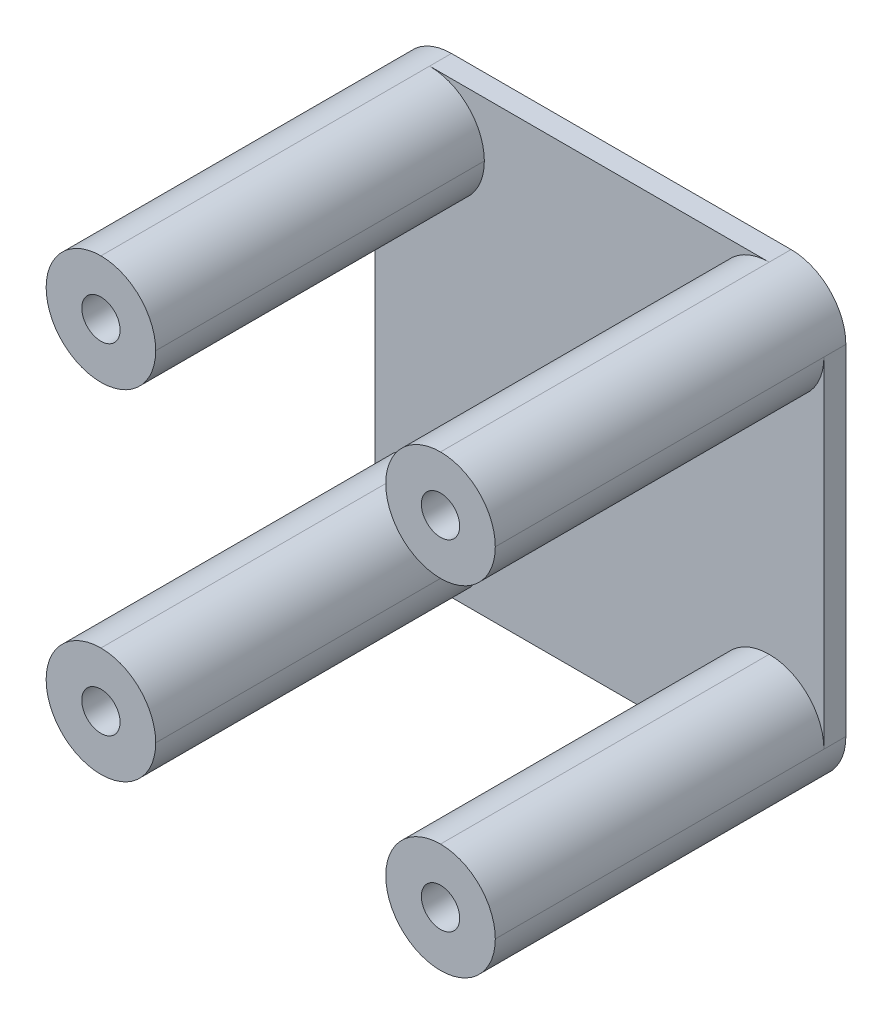
ISO-10303-21;
HEADER;
FILE_DESCRIPTION(('STEP AP214'),'2;1');
FILE_NAME('part.step','',(''),(''),'','','');
FILE_SCHEMA(('AUTOMOTIVE_DESIGN { 1 0 10303 214 1 1 1 1 }'));
ENDSEC;
DATA;
#1=APPLICATION_CONTEXT('core data for automotive mechanical design processes');
#2=APPLICATION_PROTOCOL_DEFINITION('international standard','automotive_design',2000,#1);
#3=PRODUCT_CONTEXT('',#1,'mechanical');
#4=PRODUCT('Part','Part','',(#3));
#5=PRODUCT_RELATED_PRODUCT_CATEGORY('part','',(#4));
#6=PRODUCT_DEFINITION_FORMATION('','',#4);
#7=PRODUCT_DEFINITION_CONTEXT('part definition',#1,'design');
#8=PRODUCT_DEFINITION('design','',#6,#7);
#9=PRODUCT_DEFINITION_SHAPE('','',#8);
#10=(LENGTH_UNIT() NAMED_UNIT(*) SI_UNIT(.MILLI.,.METRE.));
#11=(NAMED_UNIT(*) PLANE_ANGLE_UNIT() SI_UNIT($,.RADIAN.));
#12=(NAMED_UNIT(*) SI_UNIT($,.STERADIAN.) SOLID_ANGLE_UNIT());
#13=UNCERTAINTY_MEASURE_WITH_UNIT(LENGTH_MEASURE(1.E-05),#10,'distance_accuracy_value','');
#14=(GEOMETRIC_REPRESENTATION_CONTEXT(3) GLOBAL_UNCERTAINTY_ASSIGNED_CONTEXT((#13)) GLOBAL_UNIT_ASSIGNED_CONTEXT((#10,
#11,#12)) REPRESENTATION_CONTEXT('',''));
#15=CARTESIAN_POINT('',(0.,0.,0.));
#16=DIRECTION('',(0.,0.,1.));
#17=DIRECTION('',(1.,0.,0.));
#18=AXIS2_PLACEMENT_3D('',#15,#16,#17);
#19=CARTESIAN_POINT('',(0.,0.,2.));
#20=DIRECTION('',(0.,0.,1.));
#21=DIRECTION('',(1.,0.,0.));
#22=AXIS2_PLACEMENT_3D('',#19,#20,#21);
#23=PLANE('',#22);
#24=CARTESIAN_POINT('',(-34.5083333333333,4.35624999999999,2.));
#25=DIRECTION('',(0.,0.,1.));
#26=DIRECTION('',(1.,0.,0.));
#27=AXIS2_PLACEMENT_3D('',#24,#25,#26);
#28=CIRCLE('',#27,1.25);
#29=CARTESIAN_POINT('',(-33.2583333333333,4.35624999999999,2.));
#30=VERTEX_POINT('',#29);
#31=EDGE_CURVE('E449',#30,#30,#28,.T.);
#32=ORIENTED_EDGE('',*,*,#31,.F.);
#33=EDGE_LOOP('',(#32));
#34=FACE_BOUND('',#33,.T.);
#35=CARTESIAN_POINT('',(-19.0083333333333,19.85625,2.));
#36=DIRECTION('',(0.,0.,1.));
#37=DIRECTION('',(1.,0.,0.));
#38=AXIS2_PLACEMENT_3D('',#35,#36,#37);
#39=CIRCLE('',#38,5.);
#40=CARTESIAN_POINT('',(-14.0083333333333,19.85625,2.));
#41=VERTEX_POINT('',#40);
#42=CARTESIAN_POINT('',(-19.0083333333333,14.85625,2.));
#43=VERTEX_POINT('',#42);
#44=EDGE_CURVE('E57',#41,#43,#39,.F.);
#45=ORIENTED_EDGE('',*,*,#44,.T.);
#46=CARTESIAN_POINT('',(-19.0083333333333,19.85625,2.));
#47=DIRECTION('',(0.,0.,1.));
#48=DIRECTION('',(1.,0.,0.));
#49=AXIS2_PLACEMENT_3D('',#46,#47,#48);
#50=CIRCLE('',#49,5.);
#51=CARTESIAN_POINT('',(-24.0083333333333,19.85625,2.));
#52=VERTEX_POINT('',#51);
#53=EDGE_CURVE('E49',#43,#52,#50,.F.);
#54=ORIENTED_EDGE('',*,*,#53,.T.);
#55=CARTESIAN_POINT('',(-19.0083333333333,19.85625,2.));
#56=DIRECTION('',(0.,0.,1.));
#57=DIRECTION('',(1.,0.,0.));
#58=AXIS2_PLACEMENT_3D('',#55,#56,#57);
#59=CIRCLE('',#58,5.);
#60=CARTESIAN_POINT('',(-19.0083333333333,24.85625,2.));
#61=VERTEX_POINT('',#60);
#62=EDGE_CURVE('E219',#52,#61,#59,.F.);
#63=ORIENTED_EDGE('',*,*,#62,.T.);
#64=DIRECTION('',(-1.,0.,0.));
#65=VECTOR('',#64,1.);
#66=CARTESIAN_POINT('',(-55.0083333333333,24.85625,2.));
#67=LINE('',#66,#65);
#68=CARTESIAN_POINT('',(-50.0083333333333,24.85625,2.));
#69=VERTEX_POINT('',#68);
#70=EDGE_CURVE('E185',#61,#69,#67,.T.);
#71=ORIENTED_EDGE('',*,*,#70,.T.);
#72=CARTESIAN_POINT('',(-50.0083333333333,19.85625,2.));
#73=DIRECTION('',(0.,0.,1.));
#74=DIRECTION('',(1.,0.,0.));
#75=AXIS2_PLACEMENT_3D('',#72,#73,#74);
#76=CIRCLE('',#75,5.);
#77=CARTESIAN_POINT('',(-45.0083333333333,19.85625,2.));
#78=VERTEX_POINT('',#77);
#79=EDGE_CURVE('E237',#69,#78,#76,.F.);
#80=ORIENTED_EDGE('',*,*,#79,.T.);
#81=CARTESIAN_POINT('',(-50.0083333333333,19.85625,2.));
#82=DIRECTION('',(0.,0.,1.));
#83=DIRECTION('',(1.,0.,0.));
#84=AXIS2_PLACEMENT_3D('',#81,#82,#83);
#85=CIRCLE('',#84,5.);
#86=CARTESIAN_POINT('',(-50.0083333333333,14.85625,2.));
#87=VERTEX_POINT('',#86);
#88=EDGE_CURVE('E11',#78,#87,#85,.F.);
#89=ORIENTED_EDGE('',*,*,#88,.T.);
#90=CARTESIAN_POINT('',(-50.0083333333333,19.85625,2.));
#91=DIRECTION('',(0.,0.,1.));
#92=DIRECTION('',(1.,0.,0.));
#93=AXIS2_PLACEMENT_3D('',#90,#91,#92);
#94=CIRCLE('',#93,5.);
#95=CARTESIAN_POINT('',(-55.0083333333333,19.85625,2.));
#96=VERTEX_POINT('',#95);
#97=EDGE_CURVE('E233',#87,#96,#94,.F.);
#98=ORIENTED_EDGE('',*,*,#97,.T.);
#99=DIRECTION('',(0.,-1.,0.));
#100=VECTOR('',#99,1.);
#101=CARTESIAN_POINT('',(-55.0083333333333,24.85625,2.));
#102=LINE('',#101,#100);
#103=CARTESIAN_POINT('',(-55.0083333333333,-11.14375,2.));
#104=VERTEX_POINT('',#103);
#105=EDGE_CURVE('E205',#96,#104,#102,.T.);
#106=ORIENTED_EDGE('',*,*,#105,.T.);
#107=CARTESIAN_POINT('',(-50.0083333333333,-11.14375,2.));
#108=DIRECTION('',(0.,0.,1.));
#109=DIRECTION('',(1.,0.,0.));
#110=AXIS2_PLACEMENT_3D('',#107,#108,#109);
#111=CIRCLE('',#110,5.);
#112=CARTESIAN_POINT('',(-50.0083333333333,-6.14375000000001,2.));
#113=VERTEX_POINT('',#112);
#114=EDGE_CURVE('E230',#104,#113,#111,.F.);
#115=ORIENTED_EDGE('',*,*,#114,.T.);
#116=CARTESIAN_POINT('',(-50.0083333333333,-11.14375,2.));
#117=DIRECTION('',(0.,0.,1.));
#118=DIRECTION('',(1.,0.,0.));
#119=AXIS2_PLACEMENT_3D('',#116,#117,#118);
#120=CIRCLE('',#119,5.);
#121=CARTESIAN_POINT('',(-45.0083333333333,-11.14375,2.));
#122=VERTEX_POINT('',#121);
#123=EDGE_CURVE('E64',#113,#122,#120,.F.);
#124=ORIENTED_EDGE('',*,*,#123,.T.);
#125=CARTESIAN_POINT('',(-50.0083333333333,-11.14375,2.));
#126=DIRECTION('',(0.,0.,1.));
#127=DIRECTION('',(1.,0.,0.));
#128=AXIS2_PLACEMENT_3D('',#125,#126,#127);
#129=CIRCLE('',#128,5.);
#130=CARTESIAN_POINT('',(-50.0083333333333,-16.14375,2.));
#131=VERTEX_POINT('',#130);
#132=EDGE_CURVE('E242',#122,#131,#129,.F.);
#133=ORIENTED_EDGE('',*,*,#132,.T.);
#134=DIRECTION('',(1.,0.,0.));
#135=VECTOR('',#134,1.);
#136=CARTESIAN_POINT('',(-55.0083333333333,-16.14375,2.));
#137=LINE('',#136,#135);
#138=CARTESIAN_POINT('',(-19.0083333333333,-16.14375,2.));
#139=VERTEX_POINT('',#138);
#140=EDGE_CURVE('E417',#131,#139,#137,.T.);
#141=ORIENTED_EDGE('',*,*,#140,.T.);
#142=CARTESIAN_POINT('',(-19.0083333333333,-11.14375,2.));
#143=DIRECTION('',(0.,0.,1.));
#144=DIRECTION('',(1.,0.,0.));
#145=AXIS2_PLACEMENT_3D('',#142,#143,#144);
#146=CIRCLE('',#145,5.);
#147=CARTESIAN_POINT('',(-24.0083333333333,-11.14375,2.));
#148=VERTEX_POINT('',#147);
#149=EDGE_CURVE('E245',#139,#148,#146,.F.);
#150=ORIENTED_EDGE('',*,*,#149,.T.);
#151=CARTESIAN_POINT('',(-19.0083333333333,-11.14375,2.));
#152=DIRECTION('',(0.,0.,1.));
#153=DIRECTION('',(1.,0.,0.));
#154=AXIS2_PLACEMENT_3D('',#151,#152,#153);
#155=CIRCLE('',#154,5.);
#156=CARTESIAN_POINT('',(-19.0083333333333,-6.14375000000001,2.));
#157=VERTEX_POINT('',#156);
#158=EDGE_CURVE('E226',#148,#157,#155,.F.);
#159=ORIENTED_EDGE('',*,*,#158,.T.);
#160=CARTESIAN_POINT('',(-19.0083333333333,-11.14375,2.));
#161=DIRECTION('',(0.,0.,1.));
#162=DIRECTION('',(1.,0.,0.));
#163=AXIS2_PLACEMENT_3D('',#160,#161,#162);
#164=CIRCLE('',#163,5.);
#165=CARTESIAN_POINT('',(-14.0083333333333,-11.14375,2.));
#166=VERTEX_POINT('',#165);
#167=EDGE_CURVE('E248',#157,#166,#164,.F.);
#168=ORIENTED_EDGE('',*,*,#167,.T.);
#169=DIRECTION('',(0.,1.,0.));
#170=VECTOR('',#169,1.);
#171=CARTESIAN_POINT('',(-14.0083333333333,24.85625,2.));
#172=LINE('',#171,#170);
#173=EDGE_CURVE('E326',#166,#41,#172,.T.);
#174=ORIENTED_EDGE('',*,*,#173,.T.);
#175=EDGE_LOOP('',(#45,#54,#63,#71,#80,#89,#98,#106,#115,#124,#133,#141,#150,#159,#168,#174));
#176=FACE_BOUND('',#175,.T.);
#177=ADVANCED_FACE('F39',(#34,#176),#23,.T.);
#178=CARTESIAN_POINT('',(0.,0.,0.));
#179=DIRECTION('',(0.,0.,1.));
#180=DIRECTION('',(1.,0.,0.));
#181=AXIS2_PLACEMENT_3D('',#178,#179,#180);
#182=PLANE('',#181);
#183=DIRECTION('',(0.,1.,0.));
#184=VECTOR('',#183,1.);
#185=CARTESIAN_POINT('',(-14.0083333333333,24.85625,0.));
#186=LINE('',#185,#184);
#187=CARTESIAN_POINT('',(-14.0083333333333,-11.14375,0.));
#188=VERTEX_POINT('',#187);
#189=CARTESIAN_POINT('',(-14.0083333333333,19.85625,0.));
#190=VERTEX_POINT('',#189);
#191=EDGE_CURVE('E206',#188,#190,#186,.T.);
#192=ORIENTED_EDGE('',*,*,#191,.F.);
#193=CARTESIAN_POINT('',(-19.0083333333333,-11.14375,0.));
#194=DIRECTION('',(0.,0.,1.));
#195=DIRECTION('',(1.,0.,0.));
#196=AXIS2_PLACEMENT_3D('',#193,#194,#195);
#197=CIRCLE('',#196,5.);
#198=CARTESIAN_POINT('',(-19.0083333333333,-16.14375,0.));
#199=VERTEX_POINT('',#198);
#200=EDGE_CURVE('E214',#188,#199,#197,.F.);
#201=ORIENTED_EDGE('',*,*,#200,.T.);
#202=DIRECTION('',(1.,0.,0.));
#203=VECTOR('',#202,1.);
#204=CARTESIAN_POINT('',(-55.0083333333333,-16.14375,0.));
#205=LINE('',#204,#203);
#206=CARTESIAN_POINT('',(-50.0083333333333,-16.14375,0.));
#207=VERTEX_POINT('',#206);
#208=EDGE_CURVE('E409',#207,#199,#205,.T.);
#209=ORIENTED_EDGE('',*,*,#208,.F.);
#210=CARTESIAN_POINT('',(-50.0083333333333,-11.14375,0.));
#211=DIRECTION('',(0.,0.,1.));
#212=DIRECTION('',(1.,0.,0.));
#213=AXIS2_PLACEMENT_3D('',#210,#211,#212);
#214=CIRCLE('',#213,5.);
#215=CARTESIAN_POINT('',(-55.0083333333333,-11.14375,0.));
#216=VERTEX_POINT('',#215);
#217=EDGE_CURVE('E215',#207,#216,#214,.F.);
#218=ORIENTED_EDGE('',*,*,#217,.T.);
#219=DIRECTION('',(0.,-1.,0.));
#220=VECTOR('',#219,1.);
#221=CARTESIAN_POINT('',(-55.0083333333333,24.85625,0.));
#222=LINE('',#221,#220);
#223=CARTESIAN_POINT('',(-55.0083333333333,19.85625,0.));
#224=VERTEX_POINT('',#223);
#225=EDGE_CURVE('E421',#224,#216,#222,.T.);
#226=ORIENTED_EDGE('',*,*,#225,.F.);
#227=CARTESIAN_POINT('',(-50.0083333333333,19.85625,0.));
#228=DIRECTION('',(0.,0.,1.));
#229=DIRECTION('',(1.,0.,0.));
#230=AXIS2_PLACEMENT_3D('',#227,#228,#229);
#231=CIRCLE('',#230,5.);
#232=CARTESIAN_POINT('',(-50.0083333333333,24.85625,0.));
#233=VERTEX_POINT('',#232);
#234=EDGE_CURVE('E203',#224,#233,#231,.F.);
#235=ORIENTED_EDGE('',*,*,#234,.T.);
#236=DIRECTION('',(-1.,0.,0.));
#237=VECTOR('',#236,1.);
#238=CARTESIAN_POINT('',(-55.0083333333333,24.85625,0.));
#239=LINE('',#238,#237);
#240=CARTESIAN_POINT('',(-19.0083333333333,24.85625,0.));
#241=VERTEX_POINT('',#240);
#242=EDGE_CURVE('E183',#241,#233,#239,.T.);
#243=ORIENTED_EDGE('',*,*,#242,.F.);
#244=CARTESIAN_POINT('',(-19.0083333333333,19.85625,0.));
#245=DIRECTION('',(0.,0.,1.));
#246=DIRECTION('',(1.,0.,0.));
#247=AXIS2_PLACEMENT_3D('',#244,#245,#246);
#248=CIRCLE('',#247,5.);
#249=EDGE_CURVE('E199',#241,#190,#248,.F.);
#250=ORIENTED_EDGE('',*,*,#249,.T.);
#251=EDGE_LOOP('',(#192,#201,#209,#218,#226,#235,#243,#250));
#252=FACE_BOUND('',#251,.T.);
#253=CARTESIAN_POINT('',(-50.0083333333333,19.85625,0.));
#254=DIRECTION('',(0.,0.,1.));
#255=DIRECTION('',(1.,0.,0.));
#256=AXIS2_PLACEMENT_3D('',#253,#254,#255);
#257=CIRCLE('',#256,1.75);
#258=CARTESIAN_POINT('',(-48.2583333333333,19.85625,0.));
#259=VERTEX_POINT('',#258);
#260=EDGE_CURVE('E425',#259,#259,#257,.T.);
#261=ORIENTED_EDGE('',*,*,#260,.T.);
#262=EDGE_LOOP('',(#261));
#263=FACE_BOUND('',#262,.T.);
#264=CARTESIAN_POINT('',(-50.0083333333333,-11.14375,0.));
#265=DIRECTION('',(0.,0.,1.));
#266=DIRECTION('',(1.,0.,0.));
#267=AXIS2_PLACEMENT_3D('',#264,#265,#266);
#268=CIRCLE('',#267,1.75);
#269=CARTESIAN_POINT('',(-48.2583333333333,-11.14375,0.));
#270=VERTEX_POINT('',#269);
#271=EDGE_CURVE('E437',#270,#270,#268,.T.);
#272=ORIENTED_EDGE('',*,*,#271,.T.);
#273=EDGE_LOOP('',(#272));
#274=FACE_BOUND('',#273,.T.);
#275=CARTESIAN_POINT('',(-19.0083333333333,-11.14375,0.));
#276=DIRECTION('',(0.,0.,1.));
#277=DIRECTION('',(1.,0.,0.));
#278=AXIS2_PLACEMENT_3D('',#275,#276,#277);
#279=CIRCLE('',#278,1.75);
#280=CARTESIAN_POINT('',(-17.2583333333333,-11.14375,0.));
#281=VERTEX_POINT('',#280);
#282=EDGE_CURVE('E441',#281,#281,#279,.T.);
#283=ORIENTED_EDGE('',*,*,#282,.T.);
#284=EDGE_LOOP('',(#283));
#285=FACE_BOUND('',#284,.T.);
#286=CARTESIAN_POINT('',(-19.0083333333333,19.85625,0.));
#287=DIRECTION('',(0.,0.,1.));
#288=DIRECTION('',(1.,0.,0.));
#289=AXIS2_PLACEMENT_3D('',#286,#287,#288);
#290=CIRCLE('',#289,1.75);
#291=CARTESIAN_POINT('',(-17.2583333333333,19.85625,0.));
#292=VERTEX_POINT('',#291);
#293=EDGE_CURVE('E445',#292,#292,#290,.T.);
#294=ORIENTED_EDGE('',*,*,#293,.T.);
#295=EDGE_LOOP('',(#294));
#296=FACE_BOUND('',#295,.T.);
#297=CARTESIAN_POINT('',(-34.5083333333333,4.35624999999999,0.));
#298=DIRECTION('',(0.,0.,1.));
#299=DIRECTION('',(1.,0.,0.));
#300=AXIS2_PLACEMENT_3D('',#297,#298,#299);
#301=CIRCLE('',#300,1.25);
#302=CARTESIAN_POINT('',(-33.2583333333333,4.35624999999999,0.));
#303=VERTEX_POINT('',#302);
#304=EDGE_CURVE('E450',#303,#303,#301,.T.);
#305=ORIENTED_EDGE('',*,*,#304,.T.);
#306=EDGE_LOOP('',(#305));
#307=FACE_BOUND('',#306,.T.);
#308=ADVANCED_FACE('F197',(#252,#263,#274,#285,#296,#307),#182,.F.);
#309=CARTESIAN_POINT('',(-55.0083333333333,24.85625,2.));
#310=DIRECTION('',(1.,0.,0.));
#311=DIRECTION('',(0.,1.,0.));
#312=AXIS2_PLACEMENT_3D('',#309,#310,#311);
#313=PLANE('',#312);
#314=DIRECTION('',(0.,0.,-1.));
#315=VECTOR('',#314,1.);
#316=CARTESIAN_POINT('',(-55.0083333333333,-11.14375,2.));
#317=LINE('',#316,#315);
#318=EDGE_CURVE('E360',#216,#104,#317,.F.);
#319=ORIENTED_EDGE('',*,*,#318,.T.);
#320=ORIENTED_EDGE('',*,*,#105,.F.);
#321=DIRECTION('',(0.,0.,-1.));
#322=VECTOR('',#321,1.);
#323=CARTESIAN_POINT('',(-55.0083333333333,19.85625,2.));
#324=LINE('',#323,#322);
#325=EDGE_CURVE('E357',#96,#224,#324,.T.);
#326=ORIENTED_EDGE('',*,*,#325,.T.);
#327=ORIENTED_EDGE('',*,*,#225,.T.);
#328=EDGE_LOOP('',(#319,#320,#326,#327));
#329=FACE_BOUND('',#328,.T.);
#330=ADVANCED_FACE('F496',(#329),#313,.F.);
#331=CARTESIAN_POINT('',(-55.0083333333333,-16.14375,2.));
#332=DIRECTION('',(0.,1.,0.));
#333=DIRECTION('',(0.,0.,1.));
#334=AXIS2_PLACEMENT_3D('',#331,#332,#333);
#335=PLANE('',#334);
#336=DIRECTION('',(0.,0.,-1.));
#337=VECTOR('',#336,1.);
#338=CARTESIAN_POINT('',(-19.0083333333333,-16.14375,2.));
#339=LINE('',#338,#337);
#340=EDGE_CURVE('E391',#199,#139,#339,.F.);
#341=ORIENTED_EDGE('',*,*,#340,.T.);
#342=ORIENTED_EDGE('',*,*,#140,.F.);
#343=DIRECTION('',(0.,0.,-1.));
#344=VECTOR('',#343,1.);
#345=CARTESIAN_POINT('',(-50.0083333333333,-16.14375,2.));
#346=LINE('',#345,#344);
#347=EDGE_CURVE('E388',#131,#207,#346,.T.);
#348=ORIENTED_EDGE('',*,*,#347,.T.);
#349=ORIENTED_EDGE('',*,*,#208,.T.);
#350=EDGE_LOOP('',(#341,#342,#348,#349));
#351=FACE_BOUND('',#350,.T.);
#352=ADVANCED_FACE('F416',(#351),#335,.F.);
#353=CARTESIAN_POINT('',(-14.0083333333333,24.85625,2.));
#354=DIRECTION('',(-1.,0.,0.));
#355=DIRECTION('',(0.,-1.,0.));
#356=AXIS2_PLACEMENT_3D('',#353,#354,#355);
#357=PLANE('',#356);
#358=ORIENTED_EDGE('',*,*,#173,.F.);
#359=DIRECTION('',(0.,0.,-1.));
#360=VECTOR('',#359,1.);
#361=CARTESIAN_POINT('',(-14.0083333333333,-11.14375,2.));
#362=LINE('',#361,#360);
#363=EDGE_CURVE('E397',#166,#188,#362,.T.);
#364=ORIENTED_EDGE('',*,*,#363,.T.);
#365=ORIENTED_EDGE('',*,*,#191,.T.);
#366=DIRECTION('',(0.,0.,-1.));
#367=VECTOR('',#366,1.);
#368=CARTESIAN_POINT('',(-14.0083333333333,19.85625,2.));
#369=LINE('',#368,#367);
#370=EDGE_CURVE('E212',#190,#41,#369,.F.);
#371=ORIENTED_EDGE('',*,*,#370,.T.);
#372=EDGE_LOOP('',(#358,#364,#365,#371));
#373=FACE_BOUND('',#372,.T.);
#374=ADVANCED_FACE('F402',(#373),#357,.F.);
#375=CARTESIAN_POINT('',(-55.0083333333333,24.85625,2.));
#376=DIRECTION('',(0.,-1.,0.));
#377=DIRECTION('',(0.,0.,-1.));
#378=AXIS2_PLACEMENT_3D('',#375,#376,#377);
#379=PLANE('',#378);
#380=ORIENTED_EDGE('',*,*,#70,.F.);
#381=DIRECTION('',(0.,0.,-1.));
#382=VECTOR('',#381,1.);
#383=CARTESIAN_POINT('',(-19.0083333333333,24.85625,2.));
#384=LINE('',#383,#382);
#385=EDGE_CURVE('E179',#61,#241,#384,.T.);
#386=ORIENTED_EDGE('',*,*,#385,.T.);
#387=ORIENTED_EDGE('',*,*,#242,.T.);
#388=DIRECTION('',(0.,0.,-1.));
#389=VECTOR('',#388,1.);
#390=CARTESIAN_POINT('',(-50.0083333333333,24.85625,2.));
#391=LINE('',#390,#389);
#392=EDGE_CURVE('E193',#233,#69,#391,.F.);
#393=ORIENTED_EDGE('',*,*,#392,.T.);
#394=EDGE_LOOP('',(#380,#386,#387,#393));
#395=FACE_BOUND('',#394,.T.);
#396=ADVANCED_FACE('F181',(#395),#379,.F.);
#397=CARTESIAN_POINT('',(-50.0083333333333,19.85625,2.));
#398=DIRECTION('',(0.,0.,-1.));
#399=DIRECTION('',(-1.,0.,0.));
#400=AXIS2_PLACEMENT_3D('',#397,#398,#399);
#401=CYLINDRICAL_SURFACE('',#400,1.75);
#402=ORIENTED_EDGE('',*,*,#260,.F.);
#403=EDGE_LOOP('',(#402));
#404=FACE_BOUND('',#403,.T.);
#405=CARTESIAN_POINT('',(-50.0083333333333,19.85625,32.));
#406=DIRECTION('',(0.,0.,1.));
#407=DIRECTION('',(1.,0.,0.));
#408=AXIS2_PLACEMENT_3D('',#405,#406,#407);
#409=CIRCLE('',#408,1.75);
#410=CARTESIAN_POINT('',(-48.2583333333333,19.85625,32.));
#411=VERTEX_POINT('',#410);
#412=EDGE_CURVE('E454',#411,#411,#409,.T.);
#413=ORIENTED_EDGE('',*,*,#412,.T.);
#414=EDGE_LOOP('',(#413));
#415=FACE_BOUND('',#414,.T.);
#416=ADVANCED_FACE('F500',(#404,#415),#401,.F.);
#417=CARTESIAN_POINT('',(-50.0083333333333,-11.14375,2.));
#418=DIRECTION('',(0.,0.,-1.));
#419=DIRECTION('',(-1.,0.,0.));
#420=AXIS2_PLACEMENT_3D('',#417,#418,#419);
#421=CYLINDRICAL_SURFACE('',#420,1.75);
#422=ORIENTED_EDGE('',*,*,#271,.F.);
#423=EDGE_LOOP('',(#422));
#424=FACE_BOUND('',#423,.T.);
#425=CARTESIAN_POINT('',(-50.0083333333333,-11.14375,32.));
#426=DIRECTION('',(0.,0.,1.));
#427=DIRECTION('',(1.,0.,0.));
#428=AXIS2_PLACEMENT_3D('',#425,#426,#427);
#429=CIRCLE('',#428,1.75);
#430=CARTESIAN_POINT('',(-48.2583333333333,-11.14375,32.));
#431=VERTEX_POINT('',#430);
#432=EDGE_CURVE('E461',#431,#431,#429,.T.);
#433=ORIENTED_EDGE('',*,*,#432,.T.);
#434=EDGE_LOOP('',(#433));
#435=FACE_BOUND('',#434,.T.);
#436=ADVANCED_FACE('F705',(#424,#435),#421,.F.);
#437=CARTESIAN_POINT('',(-19.0083333333333,-11.14375,2.));
#438=DIRECTION('',(0.,0.,-1.));
#439=DIRECTION('',(-1.,0.,0.));
#440=AXIS2_PLACEMENT_3D('',#437,#438,#439);
#441=CYLINDRICAL_SURFACE('',#440,1.75);
#442=ORIENTED_EDGE('',*,*,#282,.F.);
#443=EDGE_LOOP('',(#442));
#444=FACE_BOUND('',#443,.T.);
#445=CARTESIAN_POINT('',(-19.0083333333333,-11.14375,32.));
#446=DIRECTION('',(0.,0.,1.));
#447=DIRECTION('',(1.,0.,0.));
#448=AXIS2_PLACEMENT_3D('',#445,#446,#447);
#449=CIRCLE('',#448,1.75);
#450=CARTESIAN_POINT('',(-17.2583333333333,-11.14375,32.));
#451=VERTEX_POINT('',#450);
#452=EDGE_CURVE('E465',#451,#451,#449,.T.);
#453=ORIENTED_EDGE('',*,*,#452,.T.);
#454=EDGE_LOOP('',(#453));
#455=FACE_BOUND('',#454,.T.);
#456=ADVANCED_FACE('F694',(#444,#455),#441,.F.);
#457=CARTESIAN_POINT('',(-19.0083333333333,19.85625,2.));
#458=DIRECTION('',(0.,0.,-1.));
#459=DIRECTION('',(-1.,0.,0.));
#460=AXIS2_PLACEMENT_3D('',#457,#458,#459);
#461=CYLINDRICAL_SURFACE('',#460,1.75);
#462=ORIENTED_EDGE('',*,*,#293,.F.);
#463=EDGE_LOOP('',(#462));
#464=FACE_BOUND('',#463,.T.);
#465=CARTESIAN_POINT('',(-19.0083333333333,19.85625,32.));
#466=DIRECTION('',(0.,0.,1.));
#467=DIRECTION('',(1.,0.,0.));
#468=AXIS2_PLACEMENT_3D('',#465,#466,#467);
#469=CIRCLE('',#468,1.75);
#470=CARTESIAN_POINT('',(-17.2583333333333,19.85625,32.));
#471=VERTEX_POINT('',#470);
#472=EDGE_CURVE('E270',#471,#471,#469,.T.);
#473=ORIENTED_EDGE('',*,*,#472,.T.);
#474=EDGE_LOOP('',(#473));
#475=FACE_BOUND('',#474,.T.);
#476=ADVANCED_FACE('F473',(#464,#475),#461,.F.);
#477=CARTESIAN_POINT('',(-34.5083333333333,4.35624999999999,2.));
#478=DIRECTION('',(0.,0.,-1.));
#479=DIRECTION('',(-1.,0.,0.));
#480=AXIS2_PLACEMENT_3D('',#477,#478,#479);
#481=CYLINDRICAL_SURFACE('',#480,1.25);
#482=ORIENTED_EDGE('',*,*,#31,.T.);
#483=EDGE_LOOP('',(#482));
#484=FACE_BOUND('',#483,.T.);
#485=ORIENTED_EDGE('',*,*,#304,.F.);
#486=EDGE_LOOP('',(#485));
#487=FACE_BOUND('',#486,.T.);
#488=ADVANCED_FACE('F641',(#484,#487),#481,.F.);
#489=CARTESIAN_POINT('',(0.,0.,32.));
#490=DIRECTION('',(0.,0.,1.));
#491=DIRECTION('',(1.,0.,0.));
#492=AXIS2_PLACEMENT_3D('',#489,#490,#491);
#493=PLANE('',#492);
#494=CARTESIAN_POINT('',(-50.0083333333333,19.85625,32.));
#495=DIRECTION('',(0.,0.,1.));
#496=DIRECTION('',(1.,0.,0.));
#497=AXIS2_PLACEMENT_3D('',#494,#495,#496);
#498=CIRCLE('',#497,5.);
#499=CARTESIAN_POINT('',(-55.0083333333333,19.85625,32.));
#500=VERTEX_POINT('',#499);
#501=CARTESIAN_POINT('',(-50.0083333333333,14.85625,32.));
#502=VERTEX_POINT('',#501);
#503=EDGE_CURVE('E381',#500,#502,#498,.T.);
#504=ORIENTED_EDGE('',*,*,#503,.T.);
#505=CARTESIAN_POINT('',(-50.0083333333333,19.85625,32.));
#506=DIRECTION('',(0.,0.,1.));
#507=DIRECTION('',(1.,0.,0.));
#508=AXIS2_PLACEMENT_3D('',#505,#506,#507);
#509=CIRCLE('',#508,5.);
#510=CARTESIAN_POINT('',(-45.0083333333333,19.85625,32.));
#511=VERTEX_POINT('',#510);
#512=EDGE_CURVE('E385',#502,#511,#509,.T.);
#513=ORIENTED_EDGE('',*,*,#512,.T.);
#514=CARTESIAN_POINT('',(-50.0083333333333,19.85625,32.));
#515=DIRECTION('',(0.,0.,1.));
#516=DIRECTION('',(1.,0.,0.));
#517=AXIS2_PLACEMENT_3D('',#514,#515,#516);
#518=CIRCLE('',#517,5.);
#519=CARTESIAN_POINT('',(-50.0083333333333,24.85625,32.));
#520=VERTEX_POINT('',#519);
#521=EDGE_CURVE('E322',#511,#520,#518,.T.);
#522=ORIENTED_EDGE('',*,*,#521,.T.);
#523=CARTESIAN_POINT('',(-50.0083333333333,19.85625,32.));
#524=DIRECTION('',(0.,0.,1.));
#525=DIRECTION('',(1.,0.,0.));
#526=AXIS2_PLACEMENT_3D('',#523,#524,#525);
#527=CIRCLE('',#526,5.);
#528=EDGE_CURVE('E318',#520,#500,#527,.T.);
#529=ORIENTED_EDGE('',*,*,#528,.T.);
#530=EDGE_LOOP('',(#504,#513,#522,#529));
#531=FACE_BOUND('',#530,.T.);
#532=ORIENTED_EDGE('',*,*,#412,.F.);
#533=EDGE_LOOP('',(#532));
#534=FACE_BOUND('',#533,.T.);
#535=ADVANCED_FACE('F631',(#531,#534),#493,.T.);
#536=CARTESIAN_POINT('',(0.,0.,32.));
#537=DIRECTION('',(0.,0.,-1.));
#538=DIRECTION('',(-1.,0.,0.));
#539=AXIS2_PLACEMENT_3D('',#536,#537,#538);
#540=PLANE('',#539);
#541=CARTESIAN_POINT('',(-50.0083333333333,-11.14375,32.));
#542=DIRECTION('',(0.,0.,-1.));
#543=DIRECTION('',(-1.,0.,0.));
#544=AXIS2_PLACEMENT_3D('',#541,#542,#543);
#545=CIRCLE('',#544,5.);
#546=CARTESIAN_POINT('',(-45.0083333333333,-11.14375,32.));
#547=VERTEX_POINT('',#546);
#548=CARTESIAN_POINT('',(-50.0083333333333,-6.14375000000001,32.));
#549=VERTEX_POINT('',#548);
#550=EDGE_CURVE('E370',#547,#549,#545,.F.);
#551=ORIENTED_EDGE('',*,*,#550,.T.);
#552=CARTESIAN_POINT('',(-50.0083333333333,-11.14375,32.));
#553=DIRECTION('',(0.,0.,-1.));
#554=DIRECTION('',(-1.,0.,0.));
#555=AXIS2_PLACEMENT_3D('',#552,#553,#554);
#556=CIRCLE('',#555,5.);
#557=CARTESIAN_POINT('',(-55.0083333333333,-11.14375,32.));
#558=VERTEX_POINT('',#557);
#559=EDGE_CURVE('E373',#549,#558,#556,.F.);
#560=ORIENTED_EDGE('',*,*,#559,.T.);
#561=CARTESIAN_POINT('',(-50.0083333333333,-11.14375,32.));
#562=DIRECTION('',(0.,0.,-1.));
#563=DIRECTION('',(-1.,0.,0.));
#564=AXIS2_PLACEMENT_3D('',#561,#562,#563);
#565=CIRCLE('',#564,5.);
#566=CARTESIAN_POINT('',(-50.0083333333333,-16.14375,32.));
#567=VERTEX_POINT('',#566);
#568=EDGE_CURVE('E364',#558,#567,#565,.F.);
#569=ORIENTED_EDGE('',*,*,#568,.T.);
#570=CARTESIAN_POINT('',(-50.0083333333333,-11.14375,32.));
#571=DIRECTION('',(0.,0.,-1.));
#572=DIRECTION('',(-1.,0.,0.));
#573=AXIS2_PLACEMENT_3D('',#570,#571,#572);
#574=CIRCLE('',#573,5.);
#575=EDGE_CURVE('E367',#567,#547,#574,.F.);
#576=ORIENTED_EDGE('',*,*,#575,.T.);
#577=EDGE_LOOP('',(#551,#560,#569,#576));
#578=FACE_BOUND('',#577,.T.);
#579=ORIENTED_EDGE('',*,*,#432,.F.);
#580=EDGE_LOOP('',(#579));
#581=FACE_BOUND('',#580,.T.);
#582=ADVANCED_FACE('F487',(#578,#581),#540,.F.);
#583=CARTESIAN_POINT('',(0.,0.,32.));
#584=DIRECTION('',(0.,0.,1.));
#585=DIRECTION('',(1.,0.,0.));
#586=AXIS2_PLACEMENT_3D('',#583,#584,#585);
#587=PLANE('',#586);
#588=CARTESIAN_POINT('',(-19.0083333333333,-11.14375,32.));
#589=DIRECTION('',(0.,0.,1.));
#590=DIRECTION('',(1.,0.,0.));
#591=AXIS2_PLACEMENT_3D('',#588,#589,#590);
#592=CIRCLE('',#591,5.);
#593=CARTESIAN_POINT('',(-14.0083333333333,-11.14375,32.));
#594=VERTEX_POINT('',#593);
#595=CARTESIAN_POINT('',(-19.0083333333333,-6.14375000000001,32.));
#596=VERTEX_POINT('',#595);
#597=EDGE_CURVE('E347',#594,#596,#592,.T.);
#598=ORIENTED_EDGE('',*,*,#597,.T.);
#599=CARTESIAN_POINT('',(-19.0083333333333,-11.14375,32.));
#600=DIRECTION('',(0.,0.,1.));
#601=DIRECTION('',(1.,0.,0.));
#602=AXIS2_PLACEMENT_3D('',#599,#600,#601);
#603=CIRCLE('',#602,5.);
#604=CARTESIAN_POINT('',(-24.0083333333333,-11.14375,32.));
#605=VERTEX_POINT('',#604);
#606=EDGE_CURVE('E353',#596,#605,#603,.T.);
#607=ORIENTED_EDGE('',*,*,#606,.T.);
#608=CARTESIAN_POINT('',(-19.0083333333333,-11.14375,32.));
#609=DIRECTION('',(0.,0.,1.));
#610=DIRECTION('',(1.,0.,0.));
#611=AXIS2_PLACEMENT_3D('',#608,#609,#610);
#612=CIRCLE('',#611,5.);
#613=CARTESIAN_POINT('',(-19.0083333333333,-16.14375,32.));
#614=VERTEX_POINT('',#613);
#615=EDGE_CURVE('E350',#605,#614,#612,.T.);
#616=ORIENTED_EDGE('',*,*,#615,.T.);
#617=CARTESIAN_POINT('',(-19.0083333333333,-11.14375,32.));
#618=DIRECTION('',(0.,0.,1.));
#619=DIRECTION('',(1.,0.,0.));
#620=AXIS2_PLACEMENT_3D('',#617,#618,#619);
#621=CIRCLE('',#620,5.);
#622=EDGE_CURVE('E344',#614,#594,#621,.T.);
#623=ORIENTED_EDGE('',*,*,#622,.T.);
#624=EDGE_LOOP('',(#598,#607,#616,#623));
#625=FACE_BOUND('',#624,.T.);
#626=ORIENTED_EDGE('',*,*,#452,.F.);
#627=EDGE_LOOP('',(#626));
#628=FACE_BOUND('',#627,.T.);
#629=ADVANCED_FACE('F478',(#625,#628),#587,.T.);
#630=CARTESIAN_POINT('',(0.,0.,32.));
#631=DIRECTION('',(0.,0.,-1.));
#632=DIRECTION('',(-1.,0.,0.));
#633=AXIS2_PLACEMENT_3D('',#630,#631,#632);
#634=PLANE('',#633);
#635=CARTESIAN_POINT('',(-19.0083333333333,19.85625,32.));
#636=DIRECTION('',(0.,0.,-1.));
#637=DIRECTION('',(-1.,0.,0.));
#638=AXIS2_PLACEMENT_3D('',#635,#636,#637);
#639=CIRCLE('',#638,5.);
#640=CARTESIAN_POINT('',(-19.0083333333333,24.85625,32.));
#641=VERTEX_POINT('',#640);
#642=CARTESIAN_POINT('',(-24.0083333333333,19.85625,32.));
#643=VERTEX_POINT('',#642);
#644=EDGE_CURVE('E337',#641,#643,#639,.F.);
#645=ORIENTED_EDGE('',*,*,#644,.T.);
#646=CARTESIAN_POINT('',(-19.0083333333333,19.85625,32.));
#647=DIRECTION('',(0.,0.,-1.));
#648=DIRECTION('',(-1.,0.,0.));
#649=AXIS2_PLACEMENT_3D('',#646,#647,#648);
#650=CIRCLE('',#649,5.);
#651=CARTESIAN_POINT('',(-19.0083333333333,14.85625,32.));
#652=VERTEX_POINT('',#651);
#653=EDGE_CURVE('E341',#643,#652,#650,.F.);
#654=ORIENTED_EDGE('',*,*,#653,.T.);
#655=CARTESIAN_POINT('',(-19.0083333333333,19.85625,32.));
#656=DIRECTION('',(0.,0.,-1.));
#657=DIRECTION('',(-1.,0.,0.));
#658=AXIS2_PLACEMENT_3D('',#655,#656,#657);
#659=CIRCLE('',#658,5.);
#660=CARTESIAN_POINT('',(-14.0083333333333,19.85625,32.));
#661=VERTEX_POINT('',#660);
#662=EDGE_CURVE('E334',#652,#661,#659,.F.);
#663=ORIENTED_EDGE('',*,*,#662,.T.);
#664=CARTESIAN_POINT('',(-19.0083333333333,19.85625,32.));
#665=DIRECTION('',(0.,0.,-1.));
#666=DIRECTION('',(-1.,0.,0.));
#667=AXIS2_PLACEMENT_3D('',#664,#665,#666);
#668=CIRCLE('',#667,5.);
#669=EDGE_CURVE('E192',#661,#641,#668,.F.);
#670=ORIENTED_EDGE('',*,*,#669,.T.);
#671=EDGE_LOOP('',(#645,#654,#663,#670));
#672=FACE_BOUND('',#671,.T.);
#673=ORIENTED_EDGE('',*,*,#472,.F.);
#674=EDGE_LOOP('',(#673));
#675=FACE_BOUND('',#674,.T.);
#676=ADVANCED_FACE('F475',(#672,#675),#634,.F.);
#677=CARTESIAN_POINT('',(-19.0083333333333,19.85625,2.));
#678=DIRECTION('',(0.,0.,-1.));
#679=DIRECTION('',(-1.,0.,0.));
#680=AXIS2_PLACEMENT_3D('',#677,#678,#679);
#681=CYLINDRICAL_SURFACE('',#680,5.);
#682=DIRECTION('',(0.,0.,-1.));
#683=VECTOR('',#682,1.);
#684=CARTESIAN_POINT('',(-19.0083333333333,14.85625,32.));
#685=LINE('',#684,#683);
#686=EDGE_CURVE('E263',#43,#652,#685,.F.);
#687=ORIENTED_EDGE('',*,*,#686,.F.);
#688=ORIENTED_EDGE('',*,*,#44,.F.);
#689=DIRECTION('',(0.,0.,-1.));
#690=VECTOR('',#689,1.);
#691=CARTESIAN_POINT('',(-14.0083333333333,19.85625,2.));
#692=LINE('',#691,#690);
#693=EDGE_CURVE('E267',#661,#41,#692,.T.);
#694=ORIENTED_EDGE('',*,*,#693,.F.);
#695=ORIENTED_EDGE('',*,*,#662,.F.);
#696=EDGE_LOOP('',(#687,#688,#694,#695));
#697=FACE_BOUND('',#696,.T.);
#698=ADVANCED_FACE('F477',(#697),#681,.T.);
#699=CARTESIAN_POINT('',(-19.0083333333333,19.85625,2.));
#700=DIRECTION('',(0.,0.,-1.));
#701=DIRECTION('',(-1.,0.,0.));
#702=AXIS2_PLACEMENT_3D('',#699,#700,#701);
#703=CYLINDRICAL_SURFACE('',#702,5.);
#704=ORIENTED_EDGE('',*,*,#249,.F.);
#705=ORIENTED_EDGE('',*,*,#385,.F.);
#706=DIRECTION('',(0.,0.,-1.));
#707=VECTOR('',#706,1.);
#708=CARTESIAN_POINT('',(-19.0083333333333,24.85625,2.));
#709=LINE('',#708,#707);
#710=EDGE_CURVE('E259',#641,#61,#709,.T.);
#711=ORIENTED_EDGE('',*,*,#710,.F.);
#712=ORIENTED_EDGE('',*,*,#669,.F.);
#713=ORIENTED_EDGE('',*,*,#693,.T.);
#714=ORIENTED_EDGE('',*,*,#370,.F.);
#715=EDGE_LOOP('',(#704,#705,#711,#712,#713,#714));
#716=FACE_BOUND('',#715,.T.);
#717=ADVANCED_FACE('F209',(#716),#703,.T.);
#718=CARTESIAN_POINT('',(-19.0083333333333,19.85625,32.));
#719=DIRECTION('',(0.,0.,-1.));
#720=DIRECTION('',(-1.,0.,0.));
#721=AXIS2_PLACEMENT_3D('',#718,#719,#720);
#722=CYLINDRICAL_SURFACE('',#721,5.);
#723=ORIENTED_EDGE('',*,*,#686,.T.);
#724=ORIENTED_EDGE('',*,*,#653,.F.);
#725=DIRECTION('',(0.,0.,-1.));
#726=VECTOR('',#725,1.);
#727=CARTESIAN_POINT('',(-24.0083333333333,19.85625,32.));
#728=LINE('',#727,#726);
#729=EDGE_CURVE('E256',#52,#643,#728,.F.);
#730=ORIENTED_EDGE('',*,*,#729,.F.);
#731=ORIENTED_EDGE('',*,*,#53,.F.);
#732=EDGE_LOOP('',(#723,#724,#730,#731));
#733=FACE_BOUND('',#732,.T.);
#734=ADVANCED_FACE('F515',(#733),#722,.T.);
#735=CARTESIAN_POINT('',(-19.0083333333333,19.85625,32.));
#736=DIRECTION('',(0.,0.,-1.));
#737=DIRECTION('',(-1.,0.,0.));
#738=AXIS2_PLACEMENT_3D('',#735,#736,#737);
#739=CYLINDRICAL_SURFACE('',#738,5.);
#740=ORIENTED_EDGE('',*,*,#644,.F.);
#741=ORIENTED_EDGE('',*,*,#710,.T.);
#742=ORIENTED_EDGE('',*,*,#62,.F.);
#743=ORIENTED_EDGE('',*,*,#729,.T.);
#744=EDGE_LOOP('',(#740,#741,#742,#743));
#745=FACE_BOUND('',#744,.T.);
#746=ADVANCED_FACE('F512',(#745),#739,.T.);
#747=CARTESIAN_POINT('',(-19.0083333333333,-11.14375,2.));
#748=DIRECTION('',(0.,0.,-1.));
#749=DIRECTION('',(-1.,0.,0.));
#750=AXIS2_PLACEMENT_3D('',#747,#748,#749);
#751=CYLINDRICAL_SURFACE('',#750,5.);
#752=ORIENTED_EDGE('',*,*,#200,.F.);
#753=ORIENTED_EDGE('',*,*,#363,.F.);
#754=DIRECTION('',(0.,0.,-1.));
#755=VECTOR('',#754,1.);
#756=CARTESIAN_POINT('',(-14.0083333333333,-11.14375,2.));
#757=LINE('',#756,#755);
#758=EDGE_CURVE('E260',#594,#166,#757,.T.);
#759=ORIENTED_EDGE('',*,*,#758,.F.);
#760=ORIENTED_EDGE('',*,*,#622,.F.);
#761=DIRECTION('',(0.,0.,-1.));
#762=VECTOR('',#761,1.);
#763=CARTESIAN_POINT('',(-19.0083333333333,-16.14375,2.));
#764=LINE('',#763,#762);
#765=EDGE_CURVE('E278',#139,#614,#764,.F.);
#766=ORIENTED_EDGE('',*,*,#765,.F.);
#767=ORIENTED_EDGE('',*,*,#340,.F.);
#768=EDGE_LOOP('',(#752,#753,#759,#760,#766,#767));
#769=FACE_BOUND('',#768,.T.);
#770=ADVANCED_FACE('F411',(#769),#751,.T.);
#771=CARTESIAN_POINT('',(-19.0083333333333,-11.14375,32.));
#772=DIRECTION('',(0.,0.,-1.));
#773=DIRECTION('',(-1.,0.,0.));
#774=AXIS2_PLACEMENT_3D('',#771,#772,#773);
#775=CYLINDRICAL_SURFACE('',#774,5.);
#776=ORIENTED_EDGE('',*,*,#758,.T.);
#777=ORIENTED_EDGE('',*,*,#167,.F.);
#778=DIRECTION('',(0.,0.,-1.));
#779=VECTOR('',#778,1.);
#780=CARTESIAN_POINT('',(-19.0083333333333,-6.14375000000001,32.));
#781=LINE('',#780,#779);
#782=EDGE_CURVE('E274',#596,#157,#781,.T.);
#783=ORIENTED_EDGE('',*,*,#782,.F.);
#784=ORIENTED_EDGE('',*,*,#597,.F.);
#785=EDGE_LOOP('',(#776,#777,#783,#784));
#786=FACE_BOUND('',#785,.T.);
#787=ADVANCED_FACE('F530',(#786),#775,.T.);
#788=CARTESIAN_POINT('',(-19.0083333333333,-11.14375,2.));
#789=DIRECTION('',(0.,0.,-1.));
#790=DIRECTION('',(-1.,0.,0.));
#791=AXIS2_PLACEMENT_3D('',#788,#789,#790);
#792=CYLINDRICAL_SURFACE('',#791,5.);
#793=ORIENTED_EDGE('',*,*,#765,.T.);
#794=ORIENTED_EDGE('',*,*,#615,.F.);
#795=DIRECTION('',(0.,0.,-1.));
#796=VECTOR('',#795,1.);
#797=CARTESIAN_POINT('',(-24.0083333333333,-11.14375,32.));
#798=LINE('',#797,#796);
#799=EDGE_CURVE('E271',#148,#605,#798,.F.);
#800=ORIENTED_EDGE('',*,*,#799,.F.);
#801=ORIENTED_EDGE('',*,*,#149,.F.);
#802=EDGE_LOOP('',(#793,#794,#800,#801));
#803=FACE_BOUND('',#802,.T.);
#804=ADVANCED_FACE('F526',(#803),#792,.T.);
#805=CARTESIAN_POINT('',(-19.0083333333333,-11.14375,32.));
#806=DIRECTION('',(0.,0.,-1.));
#807=DIRECTION('',(-1.,0.,0.));
#808=AXIS2_PLACEMENT_3D('',#805,#806,#807);
#809=CYLINDRICAL_SURFACE('',#808,5.);
#810=ORIENTED_EDGE('',*,*,#606,.F.);
#811=ORIENTED_EDGE('',*,*,#782,.T.);
#812=ORIENTED_EDGE('',*,*,#158,.F.);
#813=ORIENTED_EDGE('',*,*,#799,.T.);
#814=EDGE_LOOP('',(#810,#811,#812,#813));
#815=FACE_BOUND('',#814,.T.);
#816=ADVANCED_FACE('F522',(#815),#809,.T.);
#817=CARTESIAN_POINT('',(-50.0083333333333,-11.14375,32.));
#818=DIRECTION('',(0.,0.,-1.));
#819=DIRECTION('',(-1.,0.,0.));
#820=AXIS2_PLACEMENT_3D('',#817,#818,#819);
#821=CYLINDRICAL_SURFACE('',#820,5.);
#822=DIRECTION('',(0.,0.,-1.));
#823=VECTOR('',#822,1.);
#824=CARTESIAN_POINT('',(-50.0083333333333,-16.14375,2.));
#825=LINE('',#824,#823);
#826=EDGE_CURVE('E291',#131,#567,#825,.F.);
#827=ORIENTED_EDGE('',*,*,#826,.F.);
#828=ORIENTED_EDGE('',*,*,#132,.F.);
#829=DIRECTION('',(0.,0.,-1.));
#830=VECTOR('',#829,1.);
#831=CARTESIAN_POINT('',(-45.0083333333333,-11.14375,32.));
#832=LINE('',#831,#830);
#833=EDGE_CURVE('E275',#547,#122,#832,.T.);
#834=ORIENTED_EDGE('',*,*,#833,.F.);
#835=ORIENTED_EDGE('',*,*,#575,.F.);
#836=EDGE_LOOP('',(#827,#828,#834,#835));
#837=FACE_BOUND('',#836,.T.);
#838=ADVANCED_FACE('F525',(#837),#821,.T.);
#839=CARTESIAN_POINT('',(-50.0083333333333,-11.14375,32.));
#840=DIRECTION('',(0.,0.,-1.));
#841=DIRECTION('',(-1.,0.,0.));
#842=AXIS2_PLACEMENT_3D('',#839,#840,#841);
#843=CYLINDRICAL_SURFACE('',#842,5.);
#844=ORIENTED_EDGE('',*,*,#833,.T.);
#845=ORIENTED_EDGE('',*,*,#123,.F.);
#846=DIRECTION('',(0.,0.,-1.));
#847=VECTOR('',#846,1.);
#848=CARTESIAN_POINT('',(-50.0083333333333,-6.14375000000001,32.));
#849=LINE('',#848,#847);
#850=EDGE_CURVE('E288',#549,#113,#849,.T.);
#851=ORIENTED_EDGE('',*,*,#850,.F.);
#852=ORIENTED_EDGE('',*,*,#550,.F.);
#853=EDGE_LOOP('',(#844,#845,#851,#852));
#854=FACE_BOUND('',#853,.T.);
#855=ADVANCED_FACE('F544',(#854),#843,.T.);
#856=CARTESIAN_POINT('',(-50.0083333333333,-11.14375,2.));
#857=DIRECTION('',(0.,0.,-1.));
#858=DIRECTION('',(-1.,0.,0.));
#859=AXIS2_PLACEMENT_3D('',#856,#857,#858);
#860=CYLINDRICAL_SURFACE('',#859,5.);
#861=ORIENTED_EDGE('',*,*,#826,.T.);
#862=ORIENTED_EDGE('',*,*,#568,.F.);
#863=DIRECTION('',(0.,0.,-1.));
#864=VECTOR('',#863,1.);
#865=CARTESIAN_POINT('',(-55.0083333333333,-11.14375,2.));
#866=LINE('',#865,#864);
#867=EDGE_CURVE('E285',#104,#558,#866,.F.);
#868=ORIENTED_EDGE('',*,*,#867,.F.);
#869=ORIENTED_EDGE('',*,*,#318,.F.);
#870=ORIENTED_EDGE('',*,*,#217,.F.);
#871=ORIENTED_EDGE('',*,*,#347,.F.);
#872=EDGE_LOOP('',(#861,#862,#868,#869,#870,#871));
#873=FACE_BOUND('',#872,.T.);
#874=ADVANCED_FACE('F540',(#873),#860,.T.);
#875=CARTESIAN_POINT('',(-50.0083333333333,-11.14375,2.));
#876=DIRECTION('',(0.,0.,-1.));
#877=DIRECTION('',(-1.,0.,0.));
#878=AXIS2_PLACEMENT_3D('',#875,#876,#877);
#879=CYLINDRICAL_SURFACE('',#878,5.);
#880=ORIENTED_EDGE('',*,*,#559,.F.);
#881=ORIENTED_EDGE('',*,*,#850,.T.);
#882=ORIENTED_EDGE('',*,*,#114,.F.);
#883=ORIENTED_EDGE('',*,*,#867,.T.);
#884=EDGE_LOOP('',(#880,#881,#882,#883));
#885=FACE_BOUND('',#884,.T.);
#886=ADVANCED_FACE('F537',(#885),#879,.T.);
#887=CARTESIAN_POINT('',(-50.0083333333333,19.85625,2.));
#888=DIRECTION('',(0.,0.,-1.));
#889=DIRECTION('',(-1.,0.,0.));
#890=AXIS2_PLACEMENT_3D('',#887,#888,#889);
#891=CYLINDRICAL_SURFACE('',#890,5.);
#892=DIRECTION('',(0.,0.,-1.));
#893=VECTOR('',#892,1.);
#894=CARTESIAN_POINT('',(-45.0083333333333,19.85625,32.));
#895=LINE('',#894,#893);
#896=EDGE_CURVE('E304',#78,#511,#895,.F.);
#897=ORIENTED_EDGE('',*,*,#896,.F.);
#898=ORIENTED_EDGE('',*,*,#79,.F.);
#899=DIRECTION('',(0.,0.,-1.));
#900=VECTOR('',#899,1.);
#901=CARTESIAN_POINT('',(-50.0083333333333,24.85625,2.));
#902=LINE('',#901,#900);
#903=EDGE_CURVE('E43',#520,#69,#902,.T.);
#904=ORIENTED_EDGE('',*,*,#903,.F.);
#905=ORIENTED_EDGE('',*,*,#521,.F.);
#906=EDGE_LOOP('',(#897,#898,#904,#905));
#907=FACE_BOUND('',#906,.T.);
#908=ADVANCED_FACE('F41',(#907),#891,.T.);
#909=CARTESIAN_POINT('',(-50.0083333333333,19.85625,2.));
#910=DIRECTION('',(0.,0.,-1.));
#911=DIRECTION('',(-1.,0.,0.));
#912=AXIS2_PLACEMENT_3D('',#909,#910,#911);
#913=CYLINDRICAL_SURFACE('',#912,5.);
#914=ORIENTED_EDGE('',*,*,#234,.F.);
#915=ORIENTED_EDGE('',*,*,#325,.F.);
#916=DIRECTION('',(0.,0.,-1.));
#917=VECTOR('',#916,1.);
#918=CARTESIAN_POINT('',(-55.0083333333333,19.85625,2.));
#919=LINE('',#918,#917);
#920=EDGE_CURVE('E301',#500,#96,#919,.T.);
#921=ORIENTED_EDGE('',*,*,#920,.F.);
#922=ORIENTED_EDGE('',*,*,#528,.F.);
#923=ORIENTED_EDGE('',*,*,#903,.T.);
#924=ORIENTED_EDGE('',*,*,#392,.F.);
#925=EDGE_LOOP('',(#914,#915,#921,#922,#923,#924));
#926=FACE_BOUND('',#925,.T.);
#927=ADVANCED_FACE('F316',(#926),#913,.T.);
#928=CARTESIAN_POINT('',(-50.0083333333333,19.85625,32.));
#929=DIRECTION('',(0.,0.,-1.));
#930=DIRECTION('',(-1.,0.,0.));
#931=AXIS2_PLACEMENT_3D('',#928,#929,#930);
#932=CYLINDRICAL_SURFACE('',#931,5.);
#933=ORIENTED_EDGE('',*,*,#896,.T.);
#934=ORIENTED_EDGE('',*,*,#512,.F.);
#935=DIRECTION('',(0.,0.,-1.));
#936=VECTOR('',#935,1.);
#937=CARTESIAN_POINT('',(-50.0083333333333,14.85625,32.));
#938=LINE('',#937,#936);
#939=EDGE_CURVE('E298',#87,#502,#938,.F.);
#940=ORIENTED_EDGE('',*,*,#939,.F.);
#941=ORIENTED_EDGE('',*,*,#88,.F.);
#942=EDGE_LOOP('',(#933,#934,#940,#941));
#943=FACE_BOUND('',#942,.T.);
#944=ADVANCED_FACE('F555',(#943),#932,.T.);
#945=CARTESIAN_POINT('',(-50.0083333333333,19.85625,32.));
#946=DIRECTION('',(0.,0.,-1.));
#947=DIRECTION('',(-1.,0.,0.));
#948=AXIS2_PLACEMENT_3D('',#945,#946,#947);
#949=CYLINDRICAL_SURFACE('',#948,5.);
#950=ORIENTED_EDGE('',*,*,#503,.F.);
#951=ORIENTED_EDGE('',*,*,#920,.T.);
#952=ORIENTED_EDGE('',*,*,#97,.F.);
#953=ORIENTED_EDGE('',*,*,#939,.T.);
#954=EDGE_LOOP('',(#950,#951,#952,#953));
#955=FACE_BOUND('',#954,.T.);
#956=ADVANCED_FACE('F552',(#955),#949,.T.);
#957=CLOSED_SHELL('',(#177,#308,#330,#352,#374,#396,#416,#436,#456,#476,#488,#535,#582,#629,
#676,#698,#717,#734,#746,#770,#787,#804,#816,#838,#855,#874,#886,#908,#927,#944,#956));
#958=MANIFOLD_SOLID_BREP('B2',#957);
#959=ADVANCED_BREP_SHAPE_REPRESENTATION('',(#18,#958),#14);
#960=SHAPE_DEFINITION_REPRESENTATION(#9,#959);
ENDSEC;
END-ISO-10303-21;
